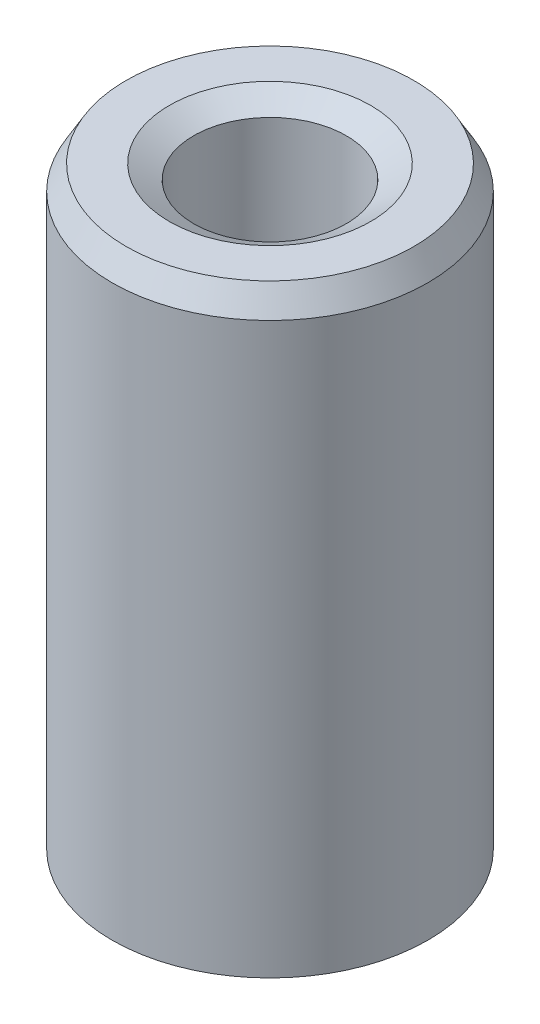
ISO-10303-21;
HEADER;
FILE_DESCRIPTION(('STEP AP214'),'2;1');
FILE_NAME('part.step','',(''),(''),'','','');
FILE_SCHEMA(('AUTOMOTIVE_DESIGN { 1 0 10303 214 1 1 1 1 }'));
ENDSEC;
DATA;
#1=APPLICATION_CONTEXT('core data for automotive mechanical design processes');
#2=APPLICATION_PROTOCOL_DEFINITION('international standard','automotive_design',2000,#1);
#3=PRODUCT_CONTEXT('',#1,'mechanical');
#4=PRODUCT('Part','Part','',(#3));
#5=PRODUCT_RELATED_PRODUCT_CATEGORY('part','',(#4));
#6=PRODUCT_DEFINITION_FORMATION('','',#4);
#7=PRODUCT_DEFINITION_CONTEXT('part definition',#1,'design');
#8=PRODUCT_DEFINITION('design','',#6,#7);
#9=PRODUCT_DEFINITION_SHAPE('','',#8);
#10=(LENGTH_UNIT() NAMED_UNIT(*) SI_UNIT(.MILLI.,.METRE.));
#11=(NAMED_UNIT(*) PLANE_ANGLE_UNIT() SI_UNIT($,.RADIAN.));
#12=(NAMED_UNIT(*) SI_UNIT($,.STERADIAN.) SOLID_ANGLE_UNIT());
#13=UNCERTAINTY_MEASURE_WITH_UNIT(LENGTH_MEASURE(1.E-05),#10,'distance_accuracy_value','');
#14=(GEOMETRIC_REPRESENTATION_CONTEXT(3) GLOBAL_UNCERTAINTY_ASSIGNED_CONTEXT((#13)) GLOBAL_UNIT_ASSIGNED_CONTEXT((#10,
#11,#12)) REPRESENTATION_CONTEXT('',''));
#15=CARTESIAN_POINT('',(0.,0.,0.));
#16=DIRECTION('',(0.,0.,1.));
#17=DIRECTION('',(1.,0.,0.));
#18=AXIS2_PLACEMENT_3D('',#15,#16,#17);
#19=CARTESIAN_POINT('',(0.,76.9647506442911,0.));
#20=DIRECTION('',(0.,-1.,0.));
#21=DIRECTION('',(0.,0.,-1.));
#22=AXIS2_PLACEMENT_3D('',#19,#20,#21);
#23=CYLINDRICAL_SURFACE('',#22,20.);
#24=CARTESIAN_POINT('',(0.,1.78027099329817,0.));
#25=DIRECTION('',(0.,1.,0.));
#26=DIRECTION('',(0.,0.,1.));
#27=AXIS2_PLACEMENT_3D('',#24,#25,#26);
#28=CIRCLE('',#27,20.);
#29=CARTESIAN_POINT('',(0.,1.78027099329817,20.));
#30=VERTEX_POINT('',#29);
#31=EDGE_CURVE('E10',#30,#30,#28,.T.);
#32=ORIENTED_EDGE('',*,*,#31,.T.);
#33=EDGE_LOOP('',(#32));
#34=FACE_BOUND('',#33,.T.);
#35=CARTESIAN_POINT('',(0.,73.8812308326576,0.));
#36=DIRECTION('',(0.,1.,0.));
#37=DIRECTION('',(0.,0.,1.));
#38=AXIS2_PLACEMENT_3D('',#35,#36,#37);
#39=CIRCLE('',#38,20.);
#40=CARTESIAN_POINT('',(0.,73.8812308326576,20.));
#41=VERTEX_POINT('',#40);
#42=EDGE_CURVE('E50',#41,#41,#39,.F.);
#43=ORIENTED_EDGE('',*,*,#42,.T.);
#44=EDGE_LOOP('',(#43));
#45=FACE_BOUND('',#44,.T.);
#46=ADVANCED_FACE('F39',(#34,#45),#23,.T.);
#47=CARTESIAN_POINT('',(0.,76.9647506442911,0.));
#48=DIRECTION('',(0.,1.,0.));
#49=DIRECTION('',(0.,0.,1.));
#50=AXIS2_PLACEMENT_3D('',#47,#48,#49);
#51=PLANE('',#50);
#52=CARTESIAN_POINT('',(0.,76.9647506442911,0.));
#53=DIRECTION('',(0.,1.,0.));
#54=DIRECTION('',(0.,0.,1.));
#55=AXIS2_PLACEMENT_3D('',#52,#53,#54);
#56=CIRCLE('',#55,12.7466351833961);
#57=CARTESIAN_POINT('',(0.,76.9647506442911,12.7466351833961));
#58=VERTEX_POINT('',#57);
#59=EDGE_CURVE('E58',#58,#58,#56,.F.);
#60=ORIENTED_EDGE('',*,*,#59,.T.);
#61=EDGE_LOOP('',(#60));
#62=FACE_BOUND('',#61,.T.);
#63=CARTESIAN_POINT('',(0.,76.9647506442911,0.));
#64=DIRECTION('',(0.,1.,0.));
#65=DIRECTION('',(0.,0.,1.));
#66=AXIS2_PLACEMENT_3D('',#63,#64,#65);
#67=CIRCLE('',#66,18.2197290067019);
#68=CARTESIAN_POINT('',(0.,76.9647506442911,18.2197290067019));
#69=VERTEX_POINT('',#68);
#70=EDGE_CURVE('E61',#69,#69,#67,.T.);
#71=ORIENTED_EDGE('',*,*,#70,.T.);
#72=EDGE_LOOP('',(#71));
#73=FACE_BOUND('',#72,.T.);
#74=ADVANCED_FACE('F88',(#62,#73),#51,.T.);
#75=CARTESIAN_POINT('',(0.,0.,0.));
#76=DIRECTION('',(0.,1.,0.));
#77=DIRECTION('',(0.,0.,1.));
#78=AXIS2_PLACEMENT_3D('',#75,#76,#77);
#79=PLANE('',#78);
#80=CARTESIAN_POINT('',(0.,0.,0.));
#81=DIRECTION('',(0.,1.,0.));
#82=DIRECTION('',(0.,0.,1.));
#83=AXIS2_PLACEMENT_3D('',#80,#81,#82);
#84=CIRCLE('',#83,11.4433863650607);
#85=CARTESIAN_POINT('',(0.,0.,11.4433863650607));
#86=VERTEX_POINT('',#85);
#87=EDGE_CURVE('E51',#86,#86,#84,.T.);
#88=ORIENTED_EDGE('',*,*,#87,.T.);
#89=EDGE_LOOP('',(#88));
#90=FACE_BOUND('',#89,.T.);
#91=CARTESIAN_POINT('',(0.,0.,0.));
#92=DIRECTION('',(0.,1.,0.));
#93=DIRECTION('',(0.,0.,1.));
#94=AXIS2_PLACEMENT_3D('',#91,#92,#93);
#95=CIRCLE('',#94,16.9164801883664);
#96=CARTESIAN_POINT('',(0.,0.,16.9164801883664));
#97=VERTEX_POINT('',#96);
#98=EDGE_CURVE('E54',#97,#97,#95,.F.);
#99=ORIENTED_EDGE('',*,*,#98,.T.);
#100=EDGE_LOOP('',(#99));
#101=FACE_BOUND('',#100,.T.);
#102=ADVANCED_FACE('F83',(#90,#101),#79,.F.);
#103=CARTESIAN_POINT('',(0.,76.9647506442911,0.));
#104=DIRECTION('',(0.,-1.,0.));
#105=DIRECTION('',(0.,0.,-1.));
#106=AXIS2_PLACEMENT_3D('',#103,#104,#105);
#107=CYLINDRICAL_SURFACE('',#106,9.66311537176252);
#108=CARTESIAN_POINT('',(0.,75.184479650993,0.));
#109=DIRECTION('',(0.,1.,0.));
#110=DIRECTION('',(0.,0.,1.));
#111=AXIS2_PLACEMENT_3D('',#108,#109,#110);
#112=CIRCLE('',#111,9.66311537176252);
#113=CARTESIAN_POINT('',(0.,75.184479650993,9.66311537176251));
#114=VERTEX_POINT('',#113);
#115=EDGE_CURVE('E67',#114,#114,#112,.T.);
#116=ORIENTED_EDGE('',*,*,#115,.T.);
#117=EDGE_LOOP('',(#116));
#118=FACE_BOUND('',#117,.T.);
#119=CARTESIAN_POINT('',(0.,3.08351981163356,0.));
#120=DIRECTION('',(0.,1.,0.));
#121=DIRECTION('',(0.,0.,1.));
#122=AXIS2_PLACEMENT_3D('',#119,#120,#121);
#123=CIRCLE('',#122,9.66311537176252);
#124=CARTESIAN_POINT('',(0.,3.08351981163356,9.66311537176252));
#125=VERTEX_POINT('',#124);
#126=EDGE_CURVE('E69',#125,#125,#123,.F.);
#127=ORIENTED_EDGE('',*,*,#126,.T.);
#128=EDGE_LOOP('',(#127));
#129=FACE_BOUND('',#128,.T.);
#130=ADVANCED_FACE('F71',(#118,#129),#107,.F.);
#131=CARTESIAN_POINT('',(0.,75.184479650993,0.));
#132=DIRECTION('',(0.,1.,0.));
#133=DIRECTION('',(0.,0.,1.));
#134=AXIS2_PLACEMENT_3D('',#131,#132,#133);
#135=CONICAL_SURFACE('',#134,9.66311537176252,1.0471975511966);
#136=CARTESIAN_POINT('',(0.,76.9647506442911,12.7466351833961));
#137=CARTESIAN_POINT('',(0.,76.9462061547776,12.7145151853582));
#138=CARTESIAN_POINT('',(0.,76.9276616652641,12.6823951873204));
#139=CARTESIAN_POINT('',(0.,76.890572686237,12.6181551912447));
#140=CARTESIAN_POINT('',(0.,76.8720281967235,12.5860351932068));
#141=CARTESIAN_POINT('',(0.,76.8349392176965,12.5217951971311));
#142=CARTESIAN_POINT('',(0.,76.816394728183,12.4896751990933));
#143=CARTESIAN_POINT('',(0.,76.7793057491559,12.4254352030176));
#144=CARTESIAN_POINT('',(0.,76.7607612596424,12.3933152049797));
#145=CARTESIAN_POINT('',(0.,76.7236722806153,12.329075208904));
#146=CARTESIAN_POINT('',(0.,76.7051277911018,12.2969552108662));
#147=CARTESIAN_POINT('',(0.,76.6680388120748,12.2327152147905));
#148=CARTESIAN_POINT('',(0.,76.6494943225613,12.2005952167526));
#149=CARTESIAN_POINT('',(0.,76.6124053435342,12.1363552206769));
#150=CARTESIAN_POINT('',(0.,76.5938608540207,12.1042352226391));
#151=CARTESIAN_POINT('',(0.,76.5567718749936,12.0399952265634));
#152=CARTESIAN_POINT('',(0.,76.5382273854801,12.0078752285255));
#153=CARTESIAN_POINT('',(0.,76.5011384064531,11.9436352324498));
#154=CARTESIAN_POINT('',(0.,76.4825939169395,11.911515234412));
#155=CARTESIAN_POINT('',(0.,76.4455049379125,11.8472752383363));
#156=CARTESIAN_POINT('',(0.,76.426960448399,11.8151552402984));
#157=CARTESIAN_POINT('',(0.,76.3898714693719,11.7509152442227));
#158=CARTESIAN_POINT('',(0.,76.3713269798584,11.7187952461849));
#159=CARTESIAN_POINT('',(0.,76.3342380008314,11.6545552501092));
#160=CARTESIAN_POINT('',(0.,76.3156935113178,11.6224352520713));
#161=CARTESIAN_POINT('',(0.,76.2786045322908,11.5581952559956));
#162=CARTESIAN_POINT('',(0.,76.2600600427773,11.5260752579578));
#163=CARTESIAN_POINT('',(0.,76.2229710637502,11.4618352618821));
#164=CARTESIAN_POINT('',(0.,76.2044265742367,11.4297152638442));
#165=CARTESIAN_POINT('',(0.,76.1673375952097,11.3654752677685));
#166=CARTESIAN_POINT('',(0.,76.1487931056962,11.3333552697307));
#167=CARTESIAN_POINT('',(0.,76.1117041266691,11.269115273655));
#168=CARTESIAN_POINT('',(0.,76.0931596371556,11.2369952756171));
#169=CARTESIAN_POINT('',(0.,76.0560706581285,11.1727552795414));
#170=CARTESIAN_POINT('',(0.,76.037526168615,11.1406352815036));
#171=CARTESIAN_POINT('',(0.,76.000437189588,11.0763952854279));
#172=CARTESIAN_POINT('',(0.,75.9818927000745,11.04427528739));
#173=CARTESIAN_POINT('',(0.,75.9448037210474,10.9800352913143));
#174=CARTESIAN_POINT('',(0.,75.9262592315339,10.9479152932765));
#175=CARTESIAN_POINT('',(0.,75.8891702525068,10.8836752972008));
#176=CARTESIAN_POINT('',(0.,75.8706257629933,10.8515552991629));
#177=CARTESIAN_POINT('',(0.,75.8335367839663,10.7873153030872));
#178=CARTESIAN_POINT('',(0.,75.8149922944528,10.7551953050494));
#179=CARTESIAN_POINT('',(0.,75.7779033154257,10.6909553089737));
#180=CARTESIAN_POINT('',(0.,75.7593588259122,10.6588353109358));
#181=CARTESIAN_POINT('',(0.,75.7222698468851,10.5945953148601));
#182=CARTESIAN_POINT('',(0.,75.7037253573716,10.5624753168223));
#183=CARTESIAN_POINT('',(0.,75.6666363783446,10.4982353207466));
#184=CARTESIAN_POINT('',(0.,75.648091888831,10.4661153227087));
#185=CARTESIAN_POINT('',(0.,75.611002909804,10.401875326633));
#186=CARTESIAN_POINT('',(0.,75.5924584202905,10.3697553285952));
#187=CARTESIAN_POINT('',(0.,75.5553694412634,10.3055153325195));
#188=CARTESIAN_POINT('',(0.,75.5368249517499,10.2733953344817));
#189=CARTESIAN_POINT('',(0.,75.4997359727229,10.209155338406));
#190=CARTESIAN_POINT('',(0.,75.4811914832093,10.1770353403681));
#191=CARTESIAN_POINT('',(0.,75.4441025041823,10.1127953442924));
#192=CARTESIAN_POINT('',(0.,75.4255580146688,10.0806753462546));
#193=CARTESIAN_POINT('',(0.,75.3884690356417,10.0164353501789));
#194=CARTESIAN_POINT('',(0.,75.3699245461282,9.984315352141));
#195=CARTESIAN_POINT('',(0.,75.3328355671012,9.92007535606531));
#196=CARTESIAN_POINT('',(0.,75.3142910775877,9.88795535802746));
#197=CARTESIAN_POINT('',(0.,75.2772020985606,9.82371536195176));
#198=CARTESIAN_POINT('',(0.,75.2586576090471,9.79159536391391));
#199=CARTESIAN_POINT('',(0.,75.22156863002,9.72735536783821));
#200=CARTESIAN_POINT('',(0.,75.2030241405065,9.69523536980036));
#201=CARTESIAN_POINT('',(0.,75.184479650993,9.66311537176251));
#202=B_SPLINE_CURVE_WITH_KNOTS('',3,(#136,#137,#138,#139,#140,#141,#142,#143,#144,#145,#146,
#147,#148,#149,#150,#151,#152,#153,#154,#155,#156,#157,#158,#159,#160,#161,#162,#163,#164,#165,
#166,#167,#168,#169,#170,#171,#172,#173,#174,#175,#176,#177,#178,#179,#180,#181,#182,#183,#184,
#185,#186,#187,#188,#189,#190,#191,#192,#193,#194,#195,#196,#197,#198,#199,#200,#201),
.UNSPECIFIED.,.F.,.F.,(4,2,2,2,2,2,2,2,2,2,2,2,2,2,2,2,2,2,2,2,2,2,2,2,2,2,2,2,2,2,2,2,4),(0.,
0.111266937081136,0.22253387416227,0.333800811243406,0.445067748324542,0.556334685405678,
0.667601622486814,0.77886855956795,0.890135496649085,1.00140243373022,1.11266937081136,
1.22393630789249,1.33520324497363,1.44647018205476,1.5577371191359,1.66900405621704,
1.78027099329817,1.89153793037931,2.00280486746044,2.11407180454158,2.22533874162271,
2.33660567870385,2.44787261578498,2.55913955286612,2.67040648994726,2.78167342702839,
2.89294036410953,3.00420730119066,3.1154742382718,3.22674117535293,3.33800811243407,
3.4492750495152,3.56054198659634),.UNSPECIFIED.);
#203=EDGE_CURVE('BSEAM77',#58,#114,#202,.T.);
#204=ORIENTED_EDGE('',*,*,#59,.F.);
#205=ORIENTED_EDGE('',*,*,#115,.F.);
#206=ORIENTED_EDGE('',*,*,#203,.T.);
#207=ORIENTED_EDGE('',*,*,#203,.F.);
#208=EDGE_LOOP('',(#204,#206,#205,#207));
#209=FACE_BOUND('',#208,.T.);
#210=ADVANCED_FACE('F77',(#209),#135,.F.);
#211=CARTESIAN_POINT('',(0.,0.,0.));
#212=DIRECTION('',(0.,-1.,0.));
#213=DIRECTION('',(0.,0.,-1.));
#214=AXIS2_PLACEMENT_3D('',#211,#212,#213);
#215=CONICAL_SURFACE('',#214,11.4433863650607,0.523598775598294);
#216=ORIENTED_EDGE('',*,*,#126,.F.);
#217=EDGE_LOOP('',(#216));
#218=FACE_BOUND('',#217,.T.);
#219=ORIENTED_EDGE('',*,*,#87,.F.);
#220=EDGE_LOOP('',(#219));
#221=FACE_BOUND('',#220,.T.);
#222=ADVANCED_FACE('F73',(#218,#221),#215,.F.);
#223=CARTESIAN_POINT('',(0.,1.78027099329817,0.));
#224=DIRECTION('',(0.,1.,0.));
#225=DIRECTION('',(0.,0.,1.));
#226=AXIS2_PLACEMENT_3D('',#223,#224,#225);
#227=CONICAL_SURFACE('',#226,20.,1.0471975511966);
#228=ORIENTED_EDGE('',*,*,#98,.F.);
#229=EDGE_LOOP('',(#228));
#230=FACE_BOUND('',#229,.T.);
#231=ORIENTED_EDGE('',*,*,#31,.F.);
#232=EDGE_LOOP('',(#231));
#233=FACE_BOUND('',#232,.T.);
#234=ADVANCED_FACE('F76',(#230,#233),#227,.T.);
#235=CARTESIAN_POINT('',(0.,76.9647506442911,0.));
#236=DIRECTION('',(0.,-1.,0.));
#237=DIRECTION('',(0.,0.,-1.));
#238=AXIS2_PLACEMENT_3D('',#235,#236,#237);
#239=CONICAL_SURFACE('',#238,18.2197290067019,0.523598775598294);
#240=ORIENTED_EDGE('',*,*,#42,.F.);
#241=EDGE_LOOP('',(#240));
#242=FACE_BOUND('',#241,.T.);
#243=ORIENTED_EDGE('',*,*,#70,.F.);
#244=EDGE_LOOP('',(#243));
#245=FACE_BOUND('',#244,.T.);
#246=ADVANCED_FACE('F45',(#242,#245),#239,.T.);
#247=CLOSED_SHELL('',(#46,#74,#102,#130,#210,#222,#234,#246));
#248=MANIFOLD_SOLID_BREP('B2',#247);
#249=ADVANCED_BREP_SHAPE_REPRESENTATION('',(#18,#248),#14);
#250=SHAPE_DEFINITION_REPRESENTATION(#9,#249);
ENDSEC;
END-ISO-10303-21;
